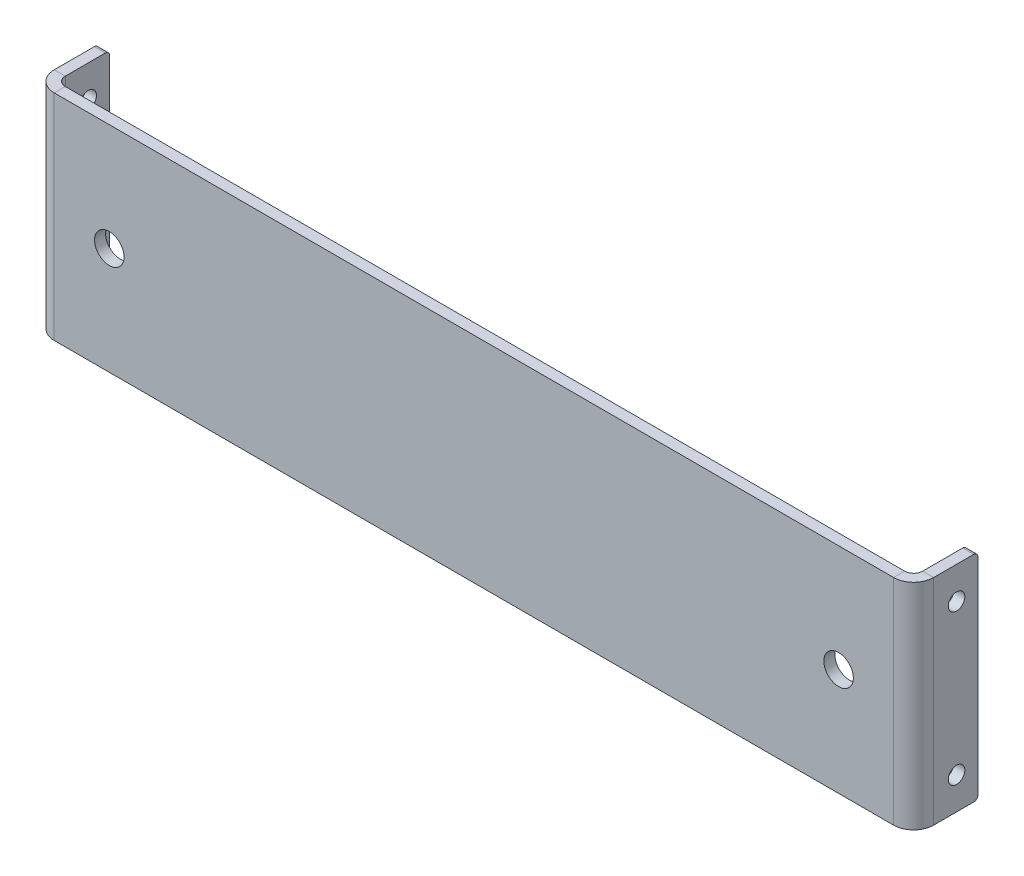
ISO-10303-21;
HEADER;
FILE_DESCRIPTION(('STEP AP214'),'2;1');
FILE_NAME('part.step','',(''),(''),'','','');
FILE_SCHEMA(('AUTOMOTIVE_DESIGN { 1 0 10303 214 1 1 1 1 }'));
ENDSEC;
DATA;
#1=APPLICATION_CONTEXT('core data for automotive mechanical design processes');
#2=APPLICATION_PROTOCOL_DEFINITION('international standard','automotive_design',2000,#1);
#3=PRODUCT_CONTEXT('',#1,'mechanical');
#4=PRODUCT('Part','Part','',(#3));
#5=PRODUCT_RELATED_PRODUCT_CATEGORY('part','',(#4));
#6=PRODUCT_DEFINITION_FORMATION('','',#4);
#7=PRODUCT_DEFINITION_CONTEXT('part definition',#1,'design');
#8=PRODUCT_DEFINITION('design','',#6,#7);
#9=PRODUCT_DEFINITION_SHAPE('','',#8);
#10=(LENGTH_UNIT() NAMED_UNIT(*) SI_UNIT(.MILLI.,.METRE.));
#11=(NAMED_UNIT(*) PLANE_ANGLE_UNIT() SI_UNIT($,.RADIAN.));
#12=(NAMED_UNIT(*) SI_UNIT($,.STERADIAN.) SOLID_ANGLE_UNIT());
#13=UNCERTAINTY_MEASURE_WITH_UNIT(LENGTH_MEASURE(1.E-05),#10,'distance_accuracy_value','');
#14=(GEOMETRIC_REPRESENTATION_CONTEXT(3) GLOBAL_UNCERTAINTY_ASSIGNED_CONTEXT((#13)) GLOBAL_UNIT_ASSIGNED_CONTEXT((#10,
#11,#12)) REPRESENTATION_CONTEXT('',''));
#15=CARTESIAN_POINT('',(0.,0.,0.));
#16=DIRECTION('',(0.,0.,1.));
#17=DIRECTION('',(1.,0.,0.));
#18=AXIS2_PLACEMENT_3D('',#15,#16,#17);
#19=CARTESIAN_POINT('',(0.,0.,-3.2639));
#20=DIRECTION('',(0.,0.,-1.));
#21=DIRECTION('',(-1.,0.,0.));
#22=AXIS2_PLACEMENT_3D('',#19,#20,#21);
#23=PLANE('',#22);
#24=CARTESIAN_POINT('',(-107.95,0.,-3.2639));
#25=DIRECTION('',(0.,0.,-1.));
#26=DIRECTION('',(-1.,0.,0.));
#27=AXIS2_PLACEMENT_3D('',#24,#25,#26);
#28=CIRCLE('',#27,4.365625);
#29=CARTESIAN_POINT('',(-112.315625,0.,-3.2639));
#30=VERTEX_POINT('',#29);
#31=EDGE_CURVE('E443',#30,#30,#28,.T.);
#32=ORIENTED_EDGE('',*,*,#31,.F.);
#33=EDGE_LOOP('',(#32));
#34=FACE_BOUND('',#33,.T.);
#35=CARTESIAN_POINT('',(107.95,0.,-3.2639));
#36=DIRECTION('',(0.,0.,-1.));
#37=DIRECTION('',(-1.,0.,0.));
#38=AXIS2_PLACEMENT_3D('',#35,#36,#37);
#39=CIRCLE('',#38,4.365625);
#40=CARTESIAN_POINT('',(103.584375,0.,-3.2639));
#41=VERTEX_POINT('',#40);
#42=EDGE_CURVE('E437',#41,#41,#39,.T.);
#43=ORIENTED_EDGE('',*,*,#42,.F.);
#44=EDGE_LOOP('',(#43));
#45=FACE_BOUND('',#44,.T.);
#46=DIRECTION('',(1.,0.,0.));
#47=VECTOR('',#46,1.);
#48=CARTESIAN_POINT('',(-130.175,-31.75,-3.2639));
#49=LINE('',#48,#47);
#50=CARTESIAN_POINT('',(-124.25426,-31.75,-3.26390000000002));
#51=VERTEX_POINT('',#50);
#52=CARTESIAN_POINT('',(124.25426,-31.75,-3.2639));
#53=VERTEX_POINT('',#52);
#54=EDGE_CURVE('E311',#51,#53,#49,.T.);
#55=ORIENTED_EDGE('',*,*,#54,.F.);
#56=DIRECTION('',(0.,1.,0.));
#57=VECTOR('',#56,1.);
#58=CARTESIAN_POINT('',(-124.25426,31.75,-3.26390000000002));
#59=LINE('',#58,#57);
#60=CARTESIAN_POINT('',(-124.25426,31.75,-3.26390000000002));
#61=VERTEX_POINT('',#60);
#62=EDGE_CURVE('E249',#61,#51,#59,.F.);
#63=ORIENTED_EDGE('',*,*,#62,.F.);
#64=DIRECTION('',(-1.,0.,0.));
#65=VECTOR('',#64,1.);
#66=CARTESIAN_POINT('',(-130.175,31.75,-3.2639));
#67=LINE('',#66,#65);
#68=CARTESIAN_POINT('',(124.25426,31.75,-3.2639));
#69=VERTEX_POINT('',#68);
#70=EDGE_CURVE('E308',#69,#61,#67,.T.);
#71=ORIENTED_EDGE('',*,*,#70,.F.);
#72=DIRECTION('',(0.,-1.,0.));
#73=VECTOR('',#72,1.);
#74=CARTESIAN_POINT('',(124.25426,-31.75,-3.26390000000002));
#75=LINE('',#74,#73);
#76=EDGE_CURVE('E298',#53,#69,#75,.F.);
#77=ORIENTED_EDGE('',*,*,#76,.F.);
#78=EDGE_LOOP('',(#55,#63,#71,#77));
#79=FACE_BOUND('',#78,.T.);
#80=ADVANCED_FACE('F78',(#34,#45,#79),#23,.T.);
#81=CARTESIAN_POINT('',(0.,0.,0.));
#82=DIRECTION('',(0.,0.,-1.));
#83=DIRECTION('',(-1.,0.,0.));
#84=AXIS2_PLACEMENT_3D('',#81,#82,#83);
#85=PLANE('',#84);
#86=CARTESIAN_POINT('',(-107.95,0.,0.));
#87=DIRECTION('',(0.,0.,1.));
#88=DIRECTION('',(1.,0.,0.));
#89=AXIS2_PLACEMENT_3D('',#86,#87,#88);
#90=CIRCLE('',#89,4.365625);
#91=CARTESIAN_POINT('',(-103.584375,0.,0.));
#92=VERTEX_POINT('',#91);
#93=EDGE_CURVE('E446',#92,#92,#90,.T.);
#94=ORIENTED_EDGE('',*,*,#93,.F.);
#95=EDGE_LOOP('',(#94));
#96=FACE_BOUND('',#95,.T.);
#97=CARTESIAN_POINT('',(107.95,0.,0.));
#98=DIRECTION('',(0.,0.,1.));
#99=DIRECTION('',(1.,0.,0.));
#100=AXIS2_PLACEMENT_3D('',#97,#98,#99);
#101=CIRCLE('',#100,4.365625);
#102=CARTESIAN_POINT('',(112.315625,0.,0.));
#103=VERTEX_POINT('',#102);
#104=EDGE_CURVE('E440',#103,#103,#101,.T.);
#105=ORIENTED_EDGE('',*,*,#104,.F.);
#106=EDGE_LOOP('',(#105));
#107=FACE_BOUND('',#106,.T.);
#108=DIRECTION('',(0.,1.,0.));
#109=VECTOR('',#108,1.);
#110=CARTESIAN_POINT('',(-124.25426,31.75,0.));
#111=LINE('',#110,#109);
#112=CARTESIAN_POINT('',(-124.25426,31.75,0.));
#113=VERTEX_POINT('',#112);
#114=CARTESIAN_POINT('',(-124.25426,-31.75,0.));
#115=VERTEX_POINT('',#114);
#116=EDGE_CURVE('E216',#113,#115,#111,.F.);
#117=ORIENTED_EDGE('',*,*,#116,.T.);
#118=DIRECTION('',(1.,0.,0.));
#119=VECTOR('',#118,1.);
#120=CARTESIAN_POINT('',(-130.175,-31.75,0.));
#121=LINE('',#120,#119);
#122=CARTESIAN_POINT('',(124.25426,-31.75,0.));
#123=VERTEX_POINT('',#122);
#124=EDGE_CURVE('E312',#115,#123,#121,.T.);
#125=ORIENTED_EDGE('',*,*,#124,.T.);
#126=DIRECTION('',(0.,-1.,0.));
#127=VECTOR('',#126,1.);
#128=CARTESIAN_POINT('',(124.25426,-31.75,0.));
#129=LINE('',#128,#127);
#130=CARTESIAN_POINT('',(124.25426,31.75,0.));
#131=VERTEX_POINT('',#130);
#132=EDGE_CURVE('E286',#123,#131,#129,.F.);
#133=ORIENTED_EDGE('',*,*,#132,.T.);
#134=DIRECTION('',(-1.,0.,0.));
#135=VECTOR('',#134,1.);
#136=CARTESIAN_POINT('',(-130.175,31.75,0.));
#137=LINE('',#136,#135);
#138=EDGE_CURVE('E306',#131,#113,#137,.T.);
#139=ORIENTED_EDGE('',*,*,#138,.T.);
#140=EDGE_LOOP('',(#117,#125,#133,#139));
#141=FACE_BOUND('',#140,.T.);
#142=ADVANCED_FACE('F393',(#96,#107,#141),#85,.F.);
#143=CARTESIAN_POINT('',(-130.175,31.75,-3.2639));
#144=DIRECTION('',(0.,1.,0.));
#145=DIRECTION('',(0.,0.,1.));
#146=AXIS2_PLACEMENT_3D('',#143,#144,#145);
#147=PLANE('',#146);
#148=ORIENTED_EDGE('',*,*,#70,.T.);
#149=DIRECTION('',(0.,0.,1.));
#150=VECTOR('',#149,1.);
#151=CARTESIAN_POINT('',(-124.25426,31.75,-3.26390000000002));
#152=LINE('',#151,#150);
#153=EDGE_CURVE('E245',#61,#113,#152,.T.);
#154=ORIENTED_EDGE('',*,*,#153,.T.);
#155=ORIENTED_EDGE('',*,*,#138,.F.);
#156=DIRECTION('',(0.,0.,1.));
#157=VECTOR('',#156,1.);
#158=CARTESIAN_POINT('',(124.25426,31.75,-3.26390000000002));
#159=LINE('',#158,#157);
#160=EDGE_CURVE('E303',#69,#131,#159,.T.);
#161=ORIENTED_EDGE('',*,*,#160,.F.);
#162=EDGE_LOOP('',(#148,#154,#155,#161));
#163=FACE_BOUND('',#162,.T.);
#164=ADVANCED_FACE('F396',(#163),#147,.T.);
#165=CARTESIAN_POINT('',(-130.175,-31.75,-3.2639));
#166=DIRECTION('',(0.,-1.,0.));
#167=DIRECTION('',(0.,0.,-1.));
#168=AXIS2_PLACEMENT_3D('',#165,#166,#167);
#169=PLANE('',#168);
#170=DIRECTION('',(0.,0.,1.));
#171=VECTOR('',#170,1.);
#172=CARTESIAN_POINT('',(-124.25426,-31.75,-3.26390000000002));
#173=LINE('',#172,#171);
#174=EDGE_CURVE('E253',#51,#115,#173,.T.);
#175=ORIENTED_EDGE('',*,*,#174,.F.);
#176=ORIENTED_EDGE('',*,*,#54,.T.);
#177=DIRECTION('',(0.,0.,1.));
#178=VECTOR('',#177,1.);
#179=CARTESIAN_POINT('',(124.25426,-31.75,-3.26390000000002));
#180=LINE('',#179,#178);
#181=EDGE_CURVE('E292',#53,#123,#180,.T.);
#182=ORIENTED_EDGE('',*,*,#181,.T.);
#183=ORIENTED_EDGE('',*,*,#124,.F.);
#184=EDGE_LOOP('',(#175,#176,#182,#183));
#185=FACE_BOUND('',#184,.T.);
#186=ADVANCED_FACE('F391',(#185),#169,.T.);
#187=CARTESIAN_POINT('',(124.25426,31.75,-5.92074000000002));
#188=DIRECTION('',(0.,1.,0.));
#189=DIRECTION('',(0.,0.,1.));
#190=AXIS2_PLACEMENT_3D('',#187,#188,#189);
#191=PLANE('',#190);
#192=DIRECTION('',(1.,0.,0.));
#193=VECTOR('',#192,1.);
#194=CARTESIAN_POINT('',(130.175,31.75,-5.92074));
#195=LINE('',#194,#193);
#196=CARTESIAN_POINT('',(126.9111,31.75,-5.92074000000001));
#197=VERTEX_POINT('',#196);
#198=CARTESIAN_POINT('',(130.175,31.75,-5.92074));
#199=VERTEX_POINT('',#198);
#200=EDGE_CURVE('E256',#197,#199,#195,.T.);
#201=ORIENTED_EDGE('',*,*,#200,.F.);
#202=CARTESIAN_POINT('',(124.25426,31.75,-5.92074000000002));
#203=DIRECTION('',(0.,-1.,0.));
#204=DIRECTION('',(0.,0.,-1.));
#205=AXIS2_PLACEMENT_3D('',#202,#203,#204);
#206=CIRCLE('',#205,2.65683999999999);
#207=EDGE_CURVE('E295',#69,#197,#206,.F.);
#208=ORIENTED_EDGE('',*,*,#207,.F.);
#209=ORIENTED_EDGE('',*,*,#160,.T.);
#210=CARTESIAN_POINT('',(124.25426,31.75,-5.92074000000002));
#211=DIRECTION('',(0.,-1.,0.));
#212=DIRECTION('',(0.,0.,-1.));
#213=AXIS2_PLACEMENT_3D('',#210,#211,#212);
#214=CIRCLE('',#213,5.92073999999999);
#215=EDGE_CURVE('E288',#131,#199,#214,.F.);
#216=ORIENTED_EDGE('',*,*,#215,.T.);
#217=EDGE_LOOP('',(#201,#208,#209,#216));
#218=FACE_BOUND('',#217,.T.);
#219=ADVANCED_FACE('F377',(#218),#191,.T.);
#220=CARTESIAN_POINT('',(124.25426,-31.75,-5.92074000000002));
#221=DIRECTION('',(0.,1.,0.));
#222=DIRECTION('',(0.,0.,1.));
#223=AXIS2_PLACEMENT_3D('',#220,#221,#222);
#224=PLANE('',#223);
#225=CARTESIAN_POINT('',(124.25426,-31.75,-5.92074000000002));
#226=DIRECTION('',(0.,-1.,0.));
#227=DIRECTION('',(0.,0.,-1.));
#228=AXIS2_PLACEMENT_3D('',#225,#226,#227);
#229=CIRCLE('',#228,2.65683999999999);
#230=CARTESIAN_POINT('',(126.9111,-31.75,-5.92074000000001));
#231=VERTEX_POINT('',#230);
#232=EDGE_CURVE('E261',#231,#53,#229,.T.);
#233=ORIENTED_EDGE('',*,*,#232,.F.);
#234=DIRECTION('',(1.,0.,0.));
#235=VECTOR('',#234,1.);
#236=CARTESIAN_POINT('',(126.9111,-31.75,-5.92074000000001));
#237=LINE('',#236,#235);
#238=CARTESIAN_POINT('',(130.175,-31.75,-5.92074));
#239=VERTEX_POINT('',#238);
#240=EDGE_CURVE('E278',#231,#239,#237,.T.);
#241=ORIENTED_EDGE('',*,*,#240,.T.);
#242=CARTESIAN_POINT('',(124.25426,-31.75,-5.92074000000002));
#243=DIRECTION('',(0.,-1.,0.));
#244=DIRECTION('',(0.,0.,-1.));
#245=AXIS2_PLACEMENT_3D('',#242,#243,#244);
#246=CIRCLE('',#245,5.92073999999999);
#247=EDGE_CURVE('E289',#239,#123,#246,.T.);
#248=ORIENTED_EDGE('',*,*,#247,.T.);
#249=ORIENTED_EDGE('',*,*,#181,.F.);
#250=EDGE_LOOP('',(#233,#241,#248,#249));
#251=FACE_BOUND('',#250,.T.);
#252=ADVANCED_FACE('F370',(#251),#224,.F.);
#253=CARTESIAN_POINT('',(124.25426,-31.75,-5.92074000000002));
#254=DIRECTION('',(0.,-1.,0.));
#255=DIRECTION('',(1.,0.,0.));
#256=AXIS2_PLACEMENT_3D('',#253,#254,#255);
#257=CYLINDRICAL_SURFACE('',#256,5.92073999999999);
#258=ORIENTED_EDGE('',*,*,#132,.F.);
#259=ORIENTED_EDGE('',*,*,#247,.F.);
#260=DIRECTION('',(0.,-1.,0.));
#261=VECTOR('',#260,1.);
#262=CARTESIAN_POINT('',(130.175,0.,-5.92074));
#263=LINE('',#262,#261);
#264=EDGE_CURVE('E275',#199,#239,#263,.T.);
#265=ORIENTED_EDGE('',*,*,#264,.F.);
#266=ORIENTED_EDGE('',*,*,#215,.F.);
#267=EDGE_LOOP('',(#258,#259,#265,#266));
#268=FACE_BOUND('',#267,.T.);
#269=ADVANCED_FACE('F375',(#268),#257,.T.);
#270=CARTESIAN_POINT('',(124.25426,-31.75,-5.92074000000002));
#271=DIRECTION('',(0.,-1.,0.));
#272=DIRECTION('',(1.,0.,0.));
#273=AXIS2_PLACEMENT_3D('',#270,#271,#272);
#274=CYLINDRICAL_SURFACE('',#273,2.65683999999999);
#275=ORIENTED_EDGE('',*,*,#76,.T.);
#276=ORIENTED_EDGE('',*,*,#207,.T.);
#277=DIRECTION('',(0.,1.,0.));
#278=VECTOR('',#277,1.);
#279=CARTESIAN_POINT('',(126.9111,31.75,-5.92074000000001));
#280=LINE('',#279,#278);
#281=EDGE_CURVE('E281',#197,#231,#280,.F.);
#282=ORIENTED_EDGE('',*,*,#281,.T.);
#283=ORIENTED_EDGE('',*,*,#232,.T.);
#284=EDGE_LOOP('',(#275,#276,#282,#283));
#285=FACE_BOUND('',#284,.T.);
#286=ADVANCED_FACE('F384',(#285),#274,.F.);
#287=CARTESIAN_POINT('',(130.175,-31.75,-3.26389999999999));
#288=DIRECTION('',(0.,-1.,0.));
#289=DIRECTION('',(0.,0.,-1.));
#290=AXIS2_PLACEMENT_3D('',#287,#288,#289);
#291=PLANE('',#290);
#292=DIRECTION('',(0.,0.,-1.));
#293=VECTOR('',#292,1.);
#294=CARTESIAN_POINT('',(126.9111,-31.75,4.57754867353493E-13));
#295=LINE('',#294,#293);
#296=CARTESIAN_POINT('',(126.9111,-31.75,-17.78));
#297=VERTEX_POINT('',#296);
#298=EDGE_CURVE('E267',#297,#231,#295,.F.);
#299=ORIENTED_EDGE('',*,*,#298,.F.);
#300=DIRECTION('',(-1.,0.,0.));
#301=VECTOR('',#300,1.);
#302=CARTESIAN_POINT('',(130.175,-31.75,-17.78));
#303=LINE('',#302,#301);
#304=CARTESIAN_POINT('',(130.175,-31.75,-17.78));
#305=VERTEX_POINT('',#304);
#306=EDGE_CURVE('E101',#297,#305,#303,.F.);
#307=ORIENTED_EDGE('',*,*,#306,.T.);
#308=DIRECTION('',(0.,0.,1.));
#309=VECTOR('',#308,1.);
#310=CARTESIAN_POINT('',(130.175,-31.75,-3.26389999999999));
#311=LINE('',#310,#309);
#312=EDGE_CURVE('E259',#305,#239,#311,.T.);
#313=ORIENTED_EDGE('',*,*,#312,.T.);
#314=ORIENTED_EDGE('',*,*,#240,.F.);
#315=EDGE_LOOP('',(#299,#307,#313,#314));
#316=FACE_BOUND('',#315,.T.);
#317=ADVANCED_FACE('F366',(#316),#291,.T.);
#318=CARTESIAN_POINT('',(130.175,31.75,-19.05));
#319=DIRECTION('',(0.,1.,0.));
#320=DIRECTION('',(0.,0.,1.));
#321=AXIS2_PLACEMENT_3D('',#318,#319,#320);
#322=PLANE('',#321);
#323=DIRECTION('',(0.,0.,-1.));
#324=VECTOR('',#323,1.);
#325=CARTESIAN_POINT('',(130.175,31.75,-19.05));
#326=LINE('',#325,#324);
#327=CARTESIAN_POINT('',(130.175,31.75,-17.78));
#328=VERTEX_POINT('',#327);
#329=EDGE_CURVE('E265',#199,#328,#326,.T.);
#330=ORIENTED_EDGE('',*,*,#329,.T.);
#331=DIRECTION('',(-1.,0.,0.));
#332=VECTOR('',#331,1.);
#333=CARTESIAN_POINT('',(130.175,31.75,-17.78));
#334=LINE('',#333,#332);
#335=CARTESIAN_POINT('',(126.9111,31.75,-17.78));
#336=VERTEX_POINT('',#335);
#337=EDGE_CURVE('E13',#328,#336,#334,.T.);
#338=ORIENTED_EDGE('',*,*,#337,.T.);
#339=DIRECTION('',(0.,0.,1.));
#340=VECTOR('',#339,1.);
#341=CARTESIAN_POINT('',(126.9111,31.75,4.43798926275643E-13));
#342=LINE('',#341,#340);
#343=EDGE_CURVE('E272',#197,#336,#342,.F.);
#344=ORIENTED_EDGE('',*,*,#343,.F.);
#345=ORIENTED_EDGE('',*,*,#200,.T.);
#346=EDGE_LOOP('',(#330,#338,#344,#345));
#347=FACE_BOUND('',#346,.T.);
#348=ADVANCED_FACE('F381',(#347),#322,.T.);
#349=CARTESIAN_POINT('',(130.175,0.,4.69150713295343E-13));
#350=DIRECTION('',(1.,0.,0.));
#351=DIRECTION('',(0.,0.,-1.));
#352=AXIS2_PLACEMENT_3D('',#349,#350,#351);
#353=PLANE('',#352);
#354=CARTESIAN_POINT('',(130.175,22.225,-12.7));
#355=DIRECTION('',(1.,0.,0.));
#356=DIRECTION('',(0.,0.,-1.));
#357=AXIS2_PLACEMENT_3D('',#354,#355,#356);
#358=CIRCLE('',#357,2.45745);
#359=CARTESIAN_POINT('',(130.175,22.225,-15.15745));
#360=VERTEX_POINT('',#359);
#361=EDGE_CURVE('E434',#360,#360,#358,.T.);
#362=ORIENTED_EDGE('',*,*,#361,.F.);
#363=EDGE_LOOP('',(#362));
#364=FACE_BOUND('',#363,.T.);
#365=CARTESIAN_POINT('',(130.175,-22.225,-12.7));
#366=DIRECTION('',(1.,0.,0.));
#367=DIRECTION('',(0.,0.,-1.));
#368=AXIS2_PLACEMENT_3D('',#365,#366,#367);
#369=CIRCLE('',#368,2.45745);
#370=CARTESIAN_POINT('',(130.175,-22.225,-15.15745));
#371=VERTEX_POINT('',#370);
#372=EDGE_CURVE('E427',#371,#371,#369,.T.);
#373=ORIENTED_EDGE('',*,*,#372,.F.);
#374=EDGE_LOOP('',(#373));
#375=FACE_BOUND('',#374,.T.);
#376=ORIENTED_EDGE('',*,*,#312,.F.);
#377=CARTESIAN_POINT('',(130.175,-30.48,-17.78));
#378=DIRECTION('',(1.,0.,0.));
#379=DIRECTION('',(0.,0.,-1.));
#380=AXIS2_PLACEMENT_3D('',#377,#378,#379);
#381=CIRCLE('',#380,1.27);
#382=CARTESIAN_POINT('',(130.175,-30.48,-19.05));
#383=VERTEX_POINT('',#382);
#384=EDGE_CURVE('E86',#305,#383,#381,.T.);
#385=ORIENTED_EDGE('',*,*,#384,.T.);
#386=DIRECTION('',(0.,-1.,0.));
#387=VECTOR('',#386,1.);
#388=CARTESIAN_POINT('',(130.175,-31.75,-19.05));
#389=LINE('',#388,#387);
#390=CARTESIAN_POINT('',(130.175,30.48,-19.05));
#391=VERTEX_POINT('',#390);
#392=EDGE_CURVE('E262',#391,#383,#389,.T.);
#393=ORIENTED_EDGE('',*,*,#392,.F.);
#394=CARTESIAN_POINT('',(130.175,30.48,-17.78));
#395=DIRECTION('',(1.,0.,0.));
#396=DIRECTION('',(0.,0.,-1.));
#397=AXIS2_PLACEMENT_3D('',#394,#395,#396);
#398=CIRCLE('',#397,1.27);
#399=EDGE_CURVE('E93',#391,#328,#398,.T.);
#400=ORIENTED_EDGE('',*,*,#399,.T.);
#401=ORIENTED_EDGE('',*,*,#329,.F.);
#402=ORIENTED_EDGE('',*,*,#264,.T.);
#403=EDGE_LOOP('',(#376,#385,#393,#400,#401,#402));
#404=FACE_BOUND('',#403,.T.);
#405=ADVANCED_FACE('F354',(#364,#375,#404),#353,.T.);
#406=CARTESIAN_POINT('',(126.9111,0.,4.57754867353493E-13));
#407=DIRECTION('',(1.,0.,0.));
#408=DIRECTION('',(0.,0.,-1.));
#409=AXIS2_PLACEMENT_3D('',#406,#407,#408);
#410=PLANE('',#409);
#411=CARTESIAN_POINT('',(126.9111,22.225,-12.7));
#412=DIRECTION('',(1.,0.,0.));
#413=DIRECTION('',(0.,0.,-1.));
#414=AXIS2_PLACEMENT_3D('',#411,#412,#413);
#415=CIRCLE('',#414,2.45744999999998);
#416=CARTESIAN_POINT('',(126.9111,22.225,-15.15745));
#417=VERTEX_POINT('',#416);
#418=EDGE_CURVE('E325',#417,#417,#415,.T.);
#419=ORIENTED_EDGE('',*,*,#418,.T.);
#420=EDGE_LOOP('',(#419));
#421=FACE_BOUND('',#420,.T.);
#422=CARTESIAN_POINT('',(126.9111,-22.225,-12.7));
#423=DIRECTION('',(1.,0.,0.));
#424=DIRECTION('',(0.,0.,-1.));
#425=AXIS2_PLACEMENT_3D('',#422,#423,#424);
#426=CIRCLE('',#425,2.45744999999998);
#427=CARTESIAN_POINT('',(126.9111,-22.225,-15.15745));
#428=VERTEX_POINT('',#427);
#429=EDGE_CURVE('E242',#428,#428,#426,.T.);
#430=ORIENTED_EDGE('',*,*,#429,.T.);
#431=EDGE_LOOP('',(#430));
#432=FACE_BOUND('',#431,.T.);
#433=DIRECTION('',(0.,1.,0.));
#434=VECTOR('',#433,1.);
#435=CARTESIAN_POINT('',(126.9111,0.,-19.05));
#436=LINE('',#435,#434);
#437=CARTESIAN_POINT('',(126.9111,30.48,-19.05));
#438=VERTEX_POINT('',#437);
#439=CARTESIAN_POINT('',(126.9111,-30.48,-19.05));
#440=VERTEX_POINT('',#439);
#441=EDGE_CURVE('E269',#438,#440,#436,.F.);
#442=ORIENTED_EDGE('',*,*,#441,.T.);
#443=CARTESIAN_POINT('',(126.9111,-30.48,-17.78));
#444=DIRECTION('',(1.,0.,0.));
#445=DIRECTION('',(0.,0.,-1.));
#446=AXIS2_PLACEMENT_3D('',#443,#444,#445);
#447=CIRCLE('',#446,1.27);
#448=EDGE_CURVE('E350',#440,#297,#447,.F.);
#449=ORIENTED_EDGE('',*,*,#448,.T.);
#450=ORIENTED_EDGE('',*,*,#298,.T.);
#451=ORIENTED_EDGE('',*,*,#281,.F.);
#452=ORIENTED_EDGE('',*,*,#343,.T.);
#453=CARTESIAN_POINT('',(126.9111,30.48,-17.78));
#454=DIRECTION('',(1.,0.,0.));
#455=DIRECTION('',(0.,0.,-1.));
#456=AXIS2_PLACEMENT_3D('',#453,#454,#455);
#457=CIRCLE('',#456,1.27);
#458=EDGE_CURVE('E348',#336,#438,#457,.F.);
#459=ORIENTED_EDGE('',*,*,#458,.T.);
#460=EDGE_LOOP('',(#442,#449,#450,#451,#452,#459));
#461=FACE_BOUND('',#460,.T.);
#462=ADVANCED_FACE('F363',(#421,#432,#461),#410,.F.);
#463=CARTESIAN_POINT('',(130.175,-31.75,-19.05));
#464=DIRECTION('',(0.,0.,-1.));
#465=DIRECTION('',(-1.,0.,0.));
#466=AXIS2_PLACEMENT_3D('',#463,#464,#465);
#467=PLANE('',#466);
#468=ORIENTED_EDGE('',*,*,#392,.T.);
#469=DIRECTION('',(-1.,0.,0.));
#470=VECTOR('',#469,1.);
#471=CARTESIAN_POINT('',(130.175,-30.48,-19.05));
#472=LINE('',#471,#470);
#473=EDGE_CURVE('E345',#383,#440,#472,.T.);
#474=ORIENTED_EDGE('',*,*,#473,.T.);
#475=ORIENTED_EDGE('',*,*,#441,.F.);
#476=DIRECTION('',(-1.,0.,0.));
#477=VECTOR('',#476,1.);
#478=CARTESIAN_POINT('',(130.175,30.48,-19.05));
#479=LINE('',#478,#477);
#480=EDGE_CURVE('E343',#438,#391,#479,.F.);
#481=ORIENTED_EDGE('',*,*,#480,.T.);
#482=EDGE_LOOP('',(#468,#474,#475,#481));
#483=FACE_BOUND('',#482,.T.);
#484=ADVANCED_FACE('F358',(#483),#467,.T.);
#485=CARTESIAN_POINT('',(-124.25426,-31.75,-5.92074000000002));
#486=DIRECTION('',(0.,-1.,0.));
#487=DIRECTION('',(0.,0.,-1.));
#488=AXIS2_PLACEMENT_3D('',#485,#486,#487);
#489=PLANE('',#488);
#490=DIRECTION('',(-1.,0.,0.));
#491=VECTOR('',#490,1.);
#492=CARTESIAN_POINT('',(-130.175,-31.75,-5.92074));
#493=LINE('',#492,#491);
#494=CARTESIAN_POINT('',(-126.9111,-31.75,-5.92074000000001));
#495=VERTEX_POINT('',#494);
#496=CARTESIAN_POINT('',(-130.175,-31.75,-5.92074));
#497=VERTEX_POINT('',#496);
#498=EDGE_CURVE('E239',#495,#497,#493,.T.);
#499=ORIENTED_EDGE('',*,*,#498,.F.);
#500=CARTESIAN_POINT('',(-124.25426,-31.75,-5.92074000000002));
#501=DIRECTION('',(0.,1.,0.));
#502=DIRECTION('',(0.,0.,1.));
#503=AXIS2_PLACEMENT_3D('',#500,#501,#502);
#504=CIRCLE('',#503,2.65683999999999);
#505=EDGE_CURVE('E219',#51,#495,#504,.F.);
#506=ORIENTED_EDGE('',*,*,#505,.F.);
#507=ORIENTED_EDGE('',*,*,#174,.T.);
#508=CARTESIAN_POINT('',(-124.25426,-31.75,-5.92074000000002));
#509=DIRECTION('',(0.,1.,0.));
#510=DIRECTION('',(0.,0.,1.));
#511=AXIS2_PLACEMENT_3D('',#508,#509,#510);
#512=CIRCLE('',#511,5.92073999999999);
#513=EDGE_CURVE('E244',#115,#497,#512,.F.);
#514=ORIENTED_EDGE('',*,*,#513,.T.);
#515=EDGE_LOOP('',(#499,#506,#507,#514));
#516=FACE_BOUND('',#515,.T.);
#517=ADVANCED_FACE('F587',(#516),#489,.T.);
#518=CARTESIAN_POINT('',(-124.25426,31.75,-5.92074000000002));
#519=DIRECTION('',(0.,-1.,0.));
#520=DIRECTION('',(0.,0.,-1.));
#521=AXIS2_PLACEMENT_3D('',#518,#519,#520);
#522=PLANE('',#521);
#523=CARTESIAN_POINT('',(-124.25426,31.75,-5.92074000000002));
#524=DIRECTION('',(0.,1.,0.));
#525=DIRECTION('',(0.,0.,1.));
#526=AXIS2_PLACEMENT_3D('',#523,#524,#525);
#527=CIRCLE('',#526,2.65683999999999);
#528=CARTESIAN_POINT('',(-126.9111,31.75,-5.92074000000001));
#529=VERTEX_POINT('',#528);
#530=EDGE_CURVE('E205',#529,#61,#527,.T.);
#531=ORIENTED_EDGE('',*,*,#530,.F.);
#532=DIRECTION('',(-1.,0.,0.));
#533=VECTOR('',#532,1.);
#534=CARTESIAN_POINT('',(-126.9111,31.75,-5.92074000000001));
#535=LINE('',#534,#533);
#536=CARTESIAN_POINT('',(-130.175,31.75,-5.92074));
#537=VERTEX_POINT('',#536);
#538=EDGE_CURVE('E199',#529,#537,#535,.T.);
#539=ORIENTED_EDGE('',*,*,#538,.T.);
#540=CARTESIAN_POINT('',(-124.25426,31.75,-5.92074000000002));
#541=DIRECTION('',(0.,1.,0.));
#542=DIRECTION('',(0.,0.,1.));
#543=AXIS2_PLACEMENT_3D('',#540,#541,#542);
#544=CIRCLE('',#543,5.92073999999999);
#545=EDGE_CURVE('E211',#537,#113,#544,.T.);
#546=ORIENTED_EDGE('',*,*,#545,.T.);
#547=ORIENTED_EDGE('',*,*,#153,.F.);
#548=EDGE_LOOP('',(#531,#539,#546,#547));
#549=FACE_BOUND('',#548,.T.);
#550=ADVANCED_FACE('F222',(#549),#522,.F.);
#551=CARTESIAN_POINT('',(-124.25426,31.75,-5.92074000000002));
#552=DIRECTION('',(0.,1.,0.));
#553=DIRECTION('',(-1.,0.,0.));
#554=AXIS2_PLACEMENT_3D('',#551,#552,#553);
#555=CYLINDRICAL_SURFACE('',#554,5.92073999999999);
#556=ORIENTED_EDGE('',*,*,#116,.F.);
#557=ORIENTED_EDGE('',*,*,#545,.F.);
#558=DIRECTION('',(0.,1.,0.));
#559=VECTOR('',#558,1.);
#560=CARTESIAN_POINT('',(-130.175,-31.75,-5.92074));
#561=LINE('',#560,#559);
#562=EDGE_CURVE('E214',#537,#497,#561,.F.);
#563=ORIENTED_EDGE('',*,*,#562,.T.);
#564=ORIENTED_EDGE('',*,*,#513,.F.);
#565=EDGE_LOOP('',(#556,#557,#563,#564));
#566=FACE_BOUND('',#565,.T.);
#567=ADVANCED_FACE('F212',(#566),#555,.T.);
#568=CARTESIAN_POINT('',(-124.25426,31.75,-5.92074000000002));
#569=DIRECTION('',(0.,1.,0.));
#570=DIRECTION('',(-1.,0.,0.));
#571=AXIS2_PLACEMENT_3D('',#568,#569,#570);
#572=CYLINDRICAL_SURFACE('',#571,2.65683999999999);
#573=ORIENTED_EDGE('',*,*,#62,.T.);
#574=ORIENTED_EDGE('',*,*,#505,.T.);
#575=DIRECTION('',(0.,1.,0.));
#576=VECTOR('',#575,1.);
#577=CARTESIAN_POINT('',(-126.9111,-31.75,-5.92074000000001));
#578=LINE('',#577,#576);
#579=EDGE_CURVE('E224',#495,#529,#578,.T.);
#580=ORIENTED_EDGE('',*,*,#579,.T.);
#581=ORIENTED_EDGE('',*,*,#530,.T.);
#582=EDGE_LOOP('',(#573,#574,#580,#581));
#583=FACE_BOUND('',#582,.T.);
#584=ADVANCED_FACE('F398',(#583),#572,.F.);
#585=CARTESIAN_POINT('',(-130.175,-31.75,-3.26389999999999));
#586=DIRECTION('',(0.,-1.,0.));
#587=DIRECTION('',(0.,0.,-1.));
#588=AXIS2_PLACEMENT_3D('',#585,#586,#587);
#589=PLANE('',#588);
#590=DIRECTION('',(0.,0.,1.));
#591=VECTOR('',#590,1.);
#592=CARTESIAN_POINT('',(-130.175,-31.75,-3.26389999999999));
#593=LINE('',#592,#591);
#594=CARTESIAN_POINT('',(-130.175,-31.75,-17.78));
#595=VERTEX_POINT('',#594);
#596=EDGE_CURVE('E229',#497,#595,#593,.F.);
#597=ORIENTED_EDGE('',*,*,#596,.T.);
#598=DIRECTION('',(1.,0.,0.));
#599=VECTOR('',#598,1.);
#600=CARTESIAN_POINT('',(-130.175,-31.75,-17.78));
#601=LINE('',#600,#599);
#602=CARTESIAN_POINT('',(-126.9111,-31.75,-17.78));
#603=VERTEX_POINT('',#602);
#604=EDGE_CURVE('E340',#595,#603,#601,.T.);
#605=ORIENTED_EDGE('',*,*,#604,.T.);
#606=DIRECTION('',(0.,0.,-1.));
#607=VECTOR('',#606,1.);
#608=CARTESIAN_POINT('',(-126.9111,-31.75,4.57754867353493E-13));
#609=LINE('',#608,#607);
#610=EDGE_CURVE('E230',#495,#603,#609,.T.);
#611=ORIENTED_EDGE('',*,*,#610,.F.);
#612=ORIENTED_EDGE('',*,*,#498,.T.);
#613=EDGE_LOOP('',(#597,#605,#611,#612));
#614=FACE_BOUND('',#613,.T.);
#615=ADVANCED_FACE('F407',(#614),#589,.T.);
#616=CARTESIAN_POINT('',(-130.175,31.75,-19.05));
#617=DIRECTION('',(0.,1.,0.));
#618=DIRECTION('',(0.,0.,1.));
#619=AXIS2_PLACEMENT_3D('',#616,#617,#618);
#620=PLANE('',#619);
#621=DIRECTION('',(0.,0.,1.));
#622=VECTOR('',#621,1.);
#623=CARTESIAN_POINT('',(-126.9111,31.75,4.43798926275643E-13));
#624=LINE('',#623,#622);
#625=CARTESIAN_POINT('',(-126.9111,31.75,-17.78));
#626=VERTEX_POINT('',#625);
#627=EDGE_CURVE('E405',#626,#529,#624,.T.);
#628=ORIENTED_EDGE('',*,*,#627,.F.);
#629=DIRECTION('',(1.,0.,0.));
#630=VECTOR('',#629,1.);
#631=CARTESIAN_POINT('',(-130.175,31.75,-17.78));
#632=LINE('',#631,#630);
#633=CARTESIAN_POINT('',(-130.175,31.75,-17.78));
#634=VERTEX_POINT('',#633);
#635=EDGE_CURVE('E201',#626,#634,#632,.F.);
#636=ORIENTED_EDGE('',*,*,#635,.T.);
#637=DIRECTION('',(0.,0.,-1.));
#638=VECTOR('',#637,1.);
#639=CARTESIAN_POINT('',(-130.175,31.75,-19.05));
#640=LINE('',#639,#638);
#641=EDGE_CURVE('E194',#634,#537,#640,.F.);
#642=ORIENTED_EDGE('',*,*,#641,.T.);
#643=ORIENTED_EDGE('',*,*,#538,.F.);
#644=EDGE_LOOP('',(#628,#636,#642,#643));
#645=FACE_BOUND('',#644,.T.);
#646=ADVANCED_FACE('F197',(#645),#620,.T.);
#647=CARTESIAN_POINT('',(-130.175,0.,4.69150713295344E-13));
#648=DIRECTION('',(1.,0.,0.));
#649=DIRECTION('',(0.,0.,-1.));
#650=AXIS2_PLACEMENT_3D('',#647,#648,#649);
#651=PLANE('',#650);
#652=CARTESIAN_POINT('',(-130.175,22.225,-12.7000000000009));
#653=DIRECTION('',(1.,0.,0.));
#654=DIRECTION('',(0.,0.,-1.));
#655=AXIS2_PLACEMENT_3D('',#652,#653,#654);
#656=CIRCLE('',#655,2.45744999999997);
#657=CARTESIAN_POINT('',(-130.175,22.225,-15.1574500000009));
#658=VERTEX_POINT('',#657);
#659=EDGE_CURVE('E326',#658,#658,#656,.T.);
#660=ORIENTED_EDGE('',*,*,#659,.T.);
#661=EDGE_LOOP('',(#660));
#662=FACE_BOUND('',#661,.T.);
#663=CARTESIAN_POINT('',(-130.175,-22.225,-12.7000000000009));
#664=DIRECTION('',(1.,0.,0.));
#665=DIRECTION('',(0.,0.,-1.));
#666=AXIS2_PLACEMENT_3D('',#663,#664,#665);
#667=CIRCLE('',#666,2.45744999999997);
#668=CARTESIAN_POINT('',(-130.175,-22.225,-15.1574500000009));
#669=VERTEX_POINT('',#668);
#670=EDGE_CURVE('E321',#669,#669,#667,.T.);
#671=ORIENTED_EDGE('',*,*,#670,.T.);
#672=EDGE_LOOP('',(#671));
#673=FACE_BOUND('',#672,.T.);
#674=ORIENTED_EDGE('',*,*,#641,.F.);
#675=CARTESIAN_POINT('',(-130.175,30.48,-17.78));
#676=DIRECTION('',(1.,0.,0.));
#677=DIRECTION('',(0.,0.,-1.));
#678=AXIS2_PLACEMENT_3D('',#675,#676,#677);
#679=CIRCLE('',#678,1.27);
#680=CARTESIAN_POINT('',(-130.175,30.48,-19.05));
#681=VERTEX_POINT('',#680);
#682=EDGE_CURVE('E338',#634,#681,#679,.F.);
#683=ORIENTED_EDGE('',*,*,#682,.T.);
#684=DIRECTION('',(0.,-1.,0.));
#685=VECTOR('',#684,1.);
#686=CARTESIAN_POINT('',(-130.175,-31.75,-19.05));
#687=LINE('',#686,#685);
#688=CARTESIAN_POINT('',(-130.175,-30.48,-19.05));
#689=VERTEX_POINT('',#688);
#690=EDGE_CURVE('E206',#689,#681,#687,.F.);
#691=ORIENTED_EDGE('',*,*,#690,.F.);
#692=CARTESIAN_POINT('',(-130.175,-30.48,-17.78));
#693=DIRECTION('',(1.,0.,0.));
#694=DIRECTION('',(0.,0.,-1.));
#695=AXIS2_PLACEMENT_3D('',#692,#693,#694);
#696=CIRCLE('',#695,1.27);
#697=EDGE_CURVE('E336',#689,#595,#696,.F.);
#698=ORIENTED_EDGE('',*,*,#697,.T.);
#699=ORIENTED_EDGE('',*,*,#596,.F.);
#700=ORIENTED_EDGE('',*,*,#562,.F.);
#701=EDGE_LOOP('',(#674,#683,#691,#698,#699,#700));
#702=FACE_BOUND('',#701,.T.);
#703=ADVANCED_FACE('F227',(#662,#673,#702),#651,.F.);
#704=CARTESIAN_POINT('',(-126.9111,0.,4.57754867353493E-13));
#705=DIRECTION('',(1.,0.,0.));
#706=DIRECTION('',(0.,0.,-1.));
#707=AXIS2_PLACEMENT_3D('',#704,#705,#706);
#708=PLANE('',#707);
#709=CARTESIAN_POINT('',(-126.9111,22.225,-12.7000000000009));
#710=DIRECTION('',(1.,0.,0.));
#711=DIRECTION('',(0.,0.,-1.));
#712=AXIS2_PLACEMENT_3D('',#709,#710,#711);
#713=CIRCLE('',#712,2.45744999999998);
#714=CARTESIAN_POINT('',(-126.9111,22.225,-15.1574500000009));
#715=VERTEX_POINT('',#714);
#716=EDGE_CURVE('E322',#715,#715,#713,.T.);
#717=ORIENTED_EDGE('',*,*,#716,.F.);
#718=EDGE_LOOP('',(#717));
#719=FACE_BOUND('',#718,.T.);
#720=CARTESIAN_POINT('',(-126.9111,-22.225,-12.7000000000009));
#721=DIRECTION('',(1.,0.,0.));
#722=DIRECTION('',(0.,0.,-1.));
#723=AXIS2_PLACEMENT_3D('',#720,#721,#722);
#724=CIRCLE('',#723,2.45744999999998);
#725=CARTESIAN_POINT('',(-126.9111,-22.225,-15.1574500000009));
#726=VERTEX_POINT('',#725);
#727=EDGE_CURVE('E318',#726,#726,#724,.T.);
#728=ORIENTED_EDGE('',*,*,#727,.F.);
#729=EDGE_LOOP('',(#728));
#730=FACE_BOUND('',#729,.T.);
#731=DIRECTION('',(0.,1.,0.));
#732=VECTOR('',#731,1.);
#733=CARTESIAN_POINT('',(-126.9111,0.,-19.05));
#734=LINE('',#733,#732);
#735=CARTESIAN_POINT('',(-126.9111,-30.48,-19.05));
#736=VERTEX_POINT('',#735);
#737=CARTESIAN_POINT('',(-126.9111,30.48,-19.05));
#738=VERTEX_POINT('',#737);
#739=EDGE_CURVE('E233',#736,#738,#734,.T.);
#740=ORIENTED_EDGE('',*,*,#739,.T.);
#741=CARTESIAN_POINT('',(-126.9111,30.48,-17.78));
#742=DIRECTION('',(1.,0.,0.));
#743=DIRECTION('',(0.,0.,-1.));
#744=AXIS2_PLACEMENT_3D('',#741,#742,#743);
#745=CIRCLE('',#744,1.27);
#746=EDGE_CURVE('E333',#738,#626,#745,.T.);
#747=ORIENTED_EDGE('',*,*,#746,.T.);
#748=ORIENTED_EDGE('',*,*,#627,.T.);
#749=ORIENTED_EDGE('',*,*,#579,.F.);
#750=ORIENTED_EDGE('',*,*,#610,.T.);
#751=CARTESIAN_POINT('',(-126.9111,-30.48,-17.78));
#752=DIRECTION('',(1.,0.,0.));
#753=DIRECTION('',(0.,0.,-1.));
#754=AXIS2_PLACEMENT_3D('',#751,#752,#753);
#755=CIRCLE('',#754,1.27);
#756=EDGE_CURVE('E331',#603,#736,#755,.T.);
#757=ORIENTED_EDGE('',*,*,#756,.T.);
#758=EDGE_LOOP('',(#740,#747,#748,#749,#750,#757));
#759=FACE_BOUND('',#758,.T.);
#760=ADVANCED_FACE('F404',(#719,#730,#759),#708,.T.);
#761=CARTESIAN_POINT('',(-130.175,-31.75,-19.05));
#762=DIRECTION('',(0.,0.,-1.));
#763=DIRECTION('',(-1.,0.,0.));
#764=AXIS2_PLACEMENT_3D('',#761,#762,#763);
#765=PLANE('',#764);
#766=ORIENTED_EDGE('',*,*,#690,.T.);
#767=DIRECTION('',(1.,0.,0.));
#768=VECTOR('',#767,1.);
#769=CARTESIAN_POINT('',(-130.175,30.48,-19.05));
#770=LINE('',#769,#768);
#771=EDGE_CURVE('E328',#681,#738,#770,.T.);
#772=ORIENTED_EDGE('',*,*,#771,.T.);
#773=ORIENTED_EDGE('',*,*,#739,.F.);
#774=DIRECTION('',(1.,0.,0.));
#775=VECTOR('',#774,1.);
#776=CARTESIAN_POINT('',(-130.175,-30.48,-19.05));
#777=LINE('',#776,#775);
#778=EDGE_CURVE('E314',#736,#689,#777,.F.);
#779=ORIENTED_EDGE('',*,*,#778,.T.);
#780=EDGE_LOOP('',(#766,#772,#773,#779));
#781=FACE_BOUND('',#780,.T.);
#782=ADVANCED_FACE('F416',(#781),#765,.T.);
#783=CARTESIAN_POINT('',(130.175,-22.225,-12.7));
#784=DIRECTION('',(1.,0.,0.));
#785=DIRECTION('',(0.,0.,-1.));
#786=AXIS2_PLACEMENT_3D('',#783,#784,#785);
#787=CYLINDRICAL_SURFACE('',#786,2.45744999999998);
#788=ORIENTED_EDGE('',*,*,#727,.T.);
#789=EDGE_LOOP('',(#788));
#790=FACE_BOUND('',#789,.T.);
#791=ORIENTED_EDGE('',*,*,#670,.F.);
#792=EDGE_LOOP('',(#791));
#793=FACE_BOUND('',#792,.T.);
#794=ADVANCED_FACE('F645',(#790,#793),#787,.F.);
#795=ORIENTED_EDGE('',*,*,#372,.T.);
#796=EDGE_LOOP('',(#795));
#797=FACE_BOUND('',#796,.T.);
#798=ORIENTED_EDGE('',*,*,#429,.F.);
#799=EDGE_LOOP('',(#798));
#800=FACE_BOUND('',#799,.T.);
#801=ADVANCED_FACE('F652',(#797,#800),#787,.F.);
#802=CARTESIAN_POINT('',(130.175,22.225,-12.7));
#803=DIRECTION('',(1.,0.,0.));
#804=DIRECTION('',(0.,0.,-1.));
#805=AXIS2_PLACEMENT_3D('',#802,#803,#804);
#806=CYLINDRICAL_SURFACE('',#805,2.45744999999998);
#807=ORIENTED_EDGE('',*,*,#716,.T.);
#808=EDGE_LOOP('',(#807));
#809=FACE_BOUND('',#808,.T.);
#810=ORIENTED_EDGE('',*,*,#659,.F.);
#811=EDGE_LOOP('',(#810));
#812=FACE_BOUND('',#811,.T.);
#813=ADVANCED_FACE('F660',(#809,#812),#806,.F.);
#814=ORIENTED_EDGE('',*,*,#361,.T.);
#815=EDGE_LOOP('',(#814));
#816=FACE_BOUND('',#815,.T.);
#817=ORIENTED_EDGE('',*,*,#418,.F.);
#818=EDGE_LOOP('',(#817));
#819=FACE_BOUND('',#818,.T.);
#820=ADVANCED_FACE('F486',(#816,#819),#806,.F.);
#821=CARTESIAN_POINT('',(-130.175,30.48,-17.78));
#822=DIRECTION('',(1.,0.,0.));
#823=DIRECTION('',(0.,0.,-1.));
#824=AXIS2_PLACEMENT_3D('',#821,#822,#823);
#825=CYLINDRICAL_SURFACE('',#824,1.27);
#826=ORIENTED_EDGE('',*,*,#682,.F.);
#827=ORIENTED_EDGE('',*,*,#635,.F.);
#828=ORIENTED_EDGE('',*,*,#746,.F.);
#829=ORIENTED_EDGE('',*,*,#771,.F.);
#830=EDGE_LOOP('',(#826,#827,#828,#829));
#831=FACE_BOUND('',#830,.T.);
#832=ADVANCED_FACE('F483',(#831),#825,.T.);
#833=CARTESIAN_POINT('',(-130.175,-30.48,-17.78));
#834=DIRECTION('',(1.,0.,0.));
#835=DIRECTION('',(0.,0.,-1.));
#836=AXIS2_PLACEMENT_3D('',#833,#834,#835);
#837=CYLINDRICAL_SURFACE('',#836,1.27);
#838=ORIENTED_EDGE('',*,*,#697,.F.);
#839=ORIENTED_EDGE('',*,*,#778,.F.);
#840=ORIENTED_EDGE('',*,*,#756,.F.);
#841=ORIENTED_EDGE('',*,*,#604,.F.);
#842=EDGE_LOOP('',(#838,#839,#840,#841));
#843=FACE_BOUND('',#842,.T.);
#844=ADVANCED_FACE('F411',(#843),#837,.T.);
#845=CARTESIAN_POINT('',(130.175,-30.48,-17.78));
#846=DIRECTION('',(-1.,0.,0.));
#847=DIRECTION('',(0.,0.,1.));
#848=AXIS2_PLACEMENT_3D('',#845,#846,#847);
#849=CYLINDRICAL_SURFACE('',#848,1.27);
#850=ORIENTED_EDGE('',*,*,#384,.F.);
#851=ORIENTED_EDGE('',*,*,#306,.F.);
#852=ORIENTED_EDGE('',*,*,#448,.F.);
#853=ORIENTED_EDGE('',*,*,#473,.F.);
#854=EDGE_LOOP('',(#850,#851,#852,#853));
#855=FACE_BOUND('',#854,.T.);
#856=ADVANCED_FACE('F361',(#855),#849,.T.);
#857=CARTESIAN_POINT('',(130.175,30.48,-17.78));
#858=DIRECTION('',(-1.,0.,0.));
#859=DIRECTION('',(0.,0.,1.));
#860=AXIS2_PLACEMENT_3D('',#857,#858,#859);
#861=CYLINDRICAL_SURFACE('',#860,1.27);
#862=ORIENTED_EDGE('',*,*,#399,.F.);
#863=ORIENTED_EDGE('',*,*,#480,.F.);
#864=ORIENTED_EDGE('',*,*,#458,.F.);
#865=ORIENTED_EDGE('',*,*,#337,.F.);
#866=EDGE_LOOP('',(#862,#863,#864,#865));
#867=FACE_BOUND('',#866,.T.);
#868=ADVANCED_FACE('F80',(#867),#861,.T.);
#869=CARTESIAN_POINT('',(107.95,0.,0.));
#870=DIRECTION('',(0.,0.,1.));
#871=DIRECTION('',(1.,0.,0.));
#872=AXIS2_PLACEMENT_3D('',#869,#870,#871);
#873=CYLINDRICAL_SURFACE('',#872,4.365625);
#874=ORIENTED_EDGE('',*,*,#42,.T.);
#875=EDGE_LOOP('',(#874));
#876=FACE_BOUND('',#875,.T.);
#877=ORIENTED_EDGE('',*,*,#104,.T.);
#878=EDGE_LOOP('',(#877));
#879=FACE_BOUND('',#878,.T.);
#880=ADVANCED_FACE('F457',(#876,#879),#873,.F.);
#881=CARTESIAN_POINT('',(-107.95,0.,0.));
#882=DIRECTION('',(0.,0.,1.));
#883=DIRECTION('',(1.,0.,0.));
#884=AXIS2_PLACEMENT_3D('',#881,#882,#883);
#885=CYLINDRICAL_SURFACE('',#884,4.365625);
#886=ORIENTED_EDGE('',*,*,#31,.T.);
#887=EDGE_LOOP('',(#886));
#888=FACE_BOUND('',#887,.T.);
#889=ORIENTED_EDGE('',*,*,#93,.T.);
#890=EDGE_LOOP('',(#889));
#891=FACE_BOUND('',#890,.T.);
#892=ADVANCED_FACE('F450',(#888,#891),#885,.F.);
#893=CLOSED_SHELL('',(#80,#142,#164,#186,#219,#252,#269,#286,#317,#348,#405,#462,#484,#517,#550,
#567,#584,#615,#646,#703,#760,#782,#794,#801,#813,#820,#832,#844,#856,#868,#880,#892));
#894=MANIFOLD_SOLID_BREP('B2',#893);
#895=ADVANCED_BREP_SHAPE_REPRESENTATION('',(#18,#894),#14);
#896=SHAPE_DEFINITION_REPRESENTATION(#9,#895);
ENDSEC;
END-ISO-10303-21;
